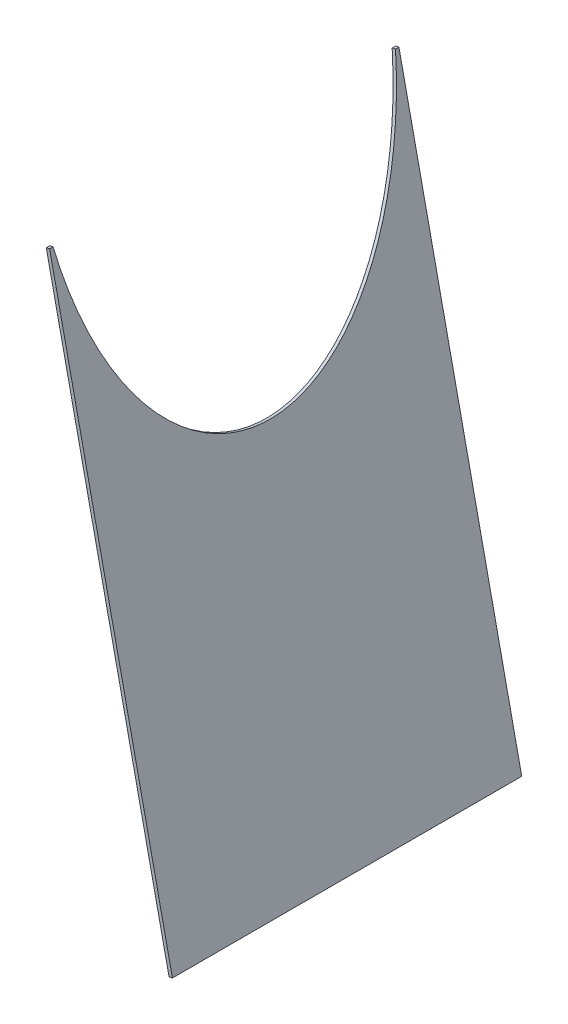
ISO-10303-21;
HEADER;
FILE_DESCRIPTION(('STEP AP214'),'2;1');
FILE_NAME('part.step','',(''),(''),'','','');
FILE_SCHEMA(('AUTOMOTIVE_DESIGN { 1 0 10303 214 1 1 1 1 }'));
ENDSEC;
DATA;
#1=APPLICATION_CONTEXT('core data for automotive mechanical design processes');
#2=APPLICATION_PROTOCOL_DEFINITION('international standard','automotive_design',2000,#1);
#3=PRODUCT_CONTEXT('',#1,'mechanical');
#4=PRODUCT('Part','Part','',(#3));
#5=PRODUCT_RELATED_PRODUCT_CATEGORY('part','',(#4));
#6=PRODUCT_DEFINITION_FORMATION('','',#4);
#7=PRODUCT_DEFINITION_CONTEXT('part definition',#1,'design');
#8=PRODUCT_DEFINITION('design','',#6,#7);
#9=PRODUCT_DEFINITION_SHAPE('','',#8);
#10=(LENGTH_UNIT() NAMED_UNIT(*) SI_UNIT(.MILLI.,.METRE.));
#11=(NAMED_UNIT(*) PLANE_ANGLE_UNIT() SI_UNIT($,.RADIAN.));
#12=(NAMED_UNIT(*) SI_UNIT($,.STERADIAN.) SOLID_ANGLE_UNIT());
#13=UNCERTAINTY_MEASURE_WITH_UNIT(LENGTH_MEASURE(1.E-05),#10,'distance_accuracy_value','');
#14=(GEOMETRIC_REPRESENTATION_CONTEXT(3) GLOBAL_UNCERTAINTY_ASSIGNED_CONTEXT((#13)) GLOBAL_UNIT_ASSIGNED_CONTEXT((#10,
#11,#12)) REPRESENTATION_CONTEXT('',''));
#15=CARTESIAN_POINT('',(0.,0.,0.));
#16=DIRECTION('',(0.,0.,1.));
#17=DIRECTION('',(1.,0.,0.));
#18=AXIS2_PLACEMENT_3D('',#15,#16,#17);
#19=CARTESIAN_POINT('',(0.,0.,102.));
#20=DIRECTION('',(0.,0.,-1.));
#21=DIRECTION('',(-1.,0.,0.));
#22=AXIS2_PLACEMENT_3D('',#19,#20,#21);
#23=PLANE('',#22);
#24=DIRECTION('',(-0.210541075170458,0.977585011989273,0.));
#25=VECTOR('',#24,1.);
#26=CARTESIAN_POINT('',(1873.05768333394,3149.43707076215,102.));
#27=LINE('',#26,#25);
#28=CARTESIAN_POINT('',(1873.05768333394,3149.43707076215,102.));
#29=VERTEX_POINT('',#28);
#30=CARTESIAN_POINT('',(1801.35282343149,3482.37731185606,102.));
#31=VERTEX_POINT('',#30);
#32=EDGE_CURVE('E118',#29,#31,#27,.T.);
#33=ORIENTED_EDGE('',*,*,#32,.T.);
#34=DIRECTION('',(0.977585011989273,0.210541075170458,0.));
#35=VECTOR('',#34,1.);
#36=CARTESIAN_POINT('',(823.767811442218,3271.8362366856,102.));
#37=LINE('',#36,#35);
#38=CARTESIAN_POINT('',(1799.39765340751,3481.95622970571,102.));
#39=VERTEX_POINT('',#38);
#40=EDGE_CURVE('E163',#39,#31,#37,.T.);
#41=ORIENTED_EDGE('',*,*,#40,.F.);
#42=DIRECTION('',(-0.210541075170458,0.977585011989273,0.));
#43=VECTOR('',#42,1.);
#44=CARTESIAN_POINT('',(1871.10251330996,3149.01598861181,102.));
#45=LINE('',#44,#43);
#46=CARTESIAN_POINT('',(1871.10251330996,3149.01598861181,102.));
#47=VERTEX_POINT('',#46);
#48=EDGE_CURVE('E162',#47,#39,#45,.T.);
#49=ORIENTED_EDGE('',*,*,#48,.F.);
#50=DIRECTION('',(-0.977585011989268,-0.210541075170482,0.));
#51=VECTOR('',#50,1.);
#52=CARTESIAN_POINT('',(1873.05768333394,3149.43707076215,102.));
#53=LINE('',#52,#51);
#54=EDGE_CURVE('E157',#29,#47,#53,.T.);
#55=ORIENTED_EDGE('',*,*,#54,.F.);
#56=EDGE_LOOP('',(#33,#41,#49,#55));
#57=FACE_BOUND('',#56,.T.);
#58=ADVANCED_FACE('F43',(#57),#23,.F.);
#59=CARTESIAN_POINT('',(0.,0.,-102.));
#60=DIRECTION('',(0.,0.,-1.));
#61=DIRECTION('',(-1.,0.,0.));
#62=AXIS2_PLACEMENT_3D('',#59,#60,#61);
#63=PLANE('',#62);
#64=DIRECTION('',(0.977585011989273,0.210541075170458,0.));
#65=VECTOR('',#64,1.);
#66=CARTESIAN_POINT('',(823.767811442218,3271.8362366856,-102.));
#67=LINE('',#66,#65);
#68=CARTESIAN_POINT('',(1799.39765340751,3481.95622970571,-102.));
#69=VERTEX_POINT('',#68);
#70=CARTESIAN_POINT('',(1801.35282343149,3482.37731185606,-102.));
#71=VERTEX_POINT('',#70);
#72=EDGE_CURVE('E102',#69,#71,#67,.T.);
#73=ORIENTED_EDGE('',*,*,#72,.T.);
#74=DIRECTION('',(-0.210541075170458,0.977585011989273,0.));
#75=VECTOR('',#74,1.);
#76=CARTESIAN_POINT('',(1873.05768333394,3149.43707076215,-102.));
#77=LINE('',#76,#75);
#78=CARTESIAN_POINT('',(1873.05768333394,3149.43707076215,-102.));
#79=VERTEX_POINT('',#78);
#80=EDGE_CURVE('E101',#79,#71,#77,.T.);
#81=ORIENTED_EDGE('',*,*,#80,.F.);
#82=DIRECTION('',(-0.977585011989268,-0.210541075170482,0.));
#83=VECTOR('',#82,1.);
#84=CARTESIAN_POINT('',(1873.05768333394,3149.43707076215,-102.));
#85=LINE('',#84,#83);
#86=CARTESIAN_POINT('',(1871.10251330996,3149.01598861181,-102.));
#87=VERTEX_POINT('',#86);
#88=EDGE_CURVE('E149',#79,#87,#85,.T.);
#89=ORIENTED_EDGE('',*,*,#88,.T.);
#90=DIRECTION('',(-0.210541075170458,0.977585011989273,0.));
#91=VECTOR('',#90,1.);
#92=CARTESIAN_POINT('',(1871.10251330996,3149.01598861181,-102.));
#93=LINE('',#92,#91);
#94=EDGE_CURVE('E109',#87,#69,#93,.T.);
#95=ORIENTED_EDGE('',*,*,#94,.T.);
#96=EDGE_LOOP('',(#73,#81,#89,#95));
#97=FACE_BOUND('',#96,.T.);
#98=ADVANCED_FACE('F129',(#97),#63,.T.);
#99=CARTESIAN_POINT('',(1873.05768333394,3149.43707076215,102.));
#100=DIRECTION('',(-0.977585011989273,-0.210541075170458,0.));
#101=DIRECTION('',(0.210541075170458,-0.977585011989273,0.));
#102=AXIS2_PLACEMENT_3D('',#99,#100,#101);
#103=PLANE('',#102);
#104=ORIENTED_EDGE('',*,*,#80,.T.);
#105=DIRECTION('',(0.,0.,-1.));
#106=VECTOR('',#105,1.);
#107=CARTESIAN_POINT('',(1801.35282343149,3482.37731185606,-99.9999999999996));
#108=LINE('',#107,#106);
#109=CARTESIAN_POINT('',(1801.35282343149,3482.37731185606,-99.9999999999996));
#110=VERTEX_POINT('',#109);
#111=EDGE_CURVE('E95',#110,#71,#108,.T.);
#112=ORIENTED_EDGE('',*,*,#111,.F.);
#113=CARTESIAN_POINT('',(1793.85026431913,3517.21321897713,0.));
#114=DIRECTION('',(-0.977585011989273,-0.210541075170458,0.));
#115=DIRECTION('',(-0.210541075170458,0.977585011989273,0.));
#116=AXIS2_PLACEMENT_3D('',#113,#114,#115);
#117=ELLIPSE('',#116,162.335662138775,102.5);
#118=CARTESIAN_POINT('',(1801.35282343149,3482.37731185606,99.9999999999996));
#119=VERTEX_POINT('',#118);
#120=EDGE_CURVE('E65',#110,#119,#117,.T.);
#121=ORIENTED_EDGE('',*,*,#120,.T.);
#122=DIRECTION('',(0.,0.,-1.));
#123=VECTOR('',#122,1.);
#124=CARTESIAN_POINT('',(1801.35282343149,3482.37731185606,102.));
#125=LINE('',#124,#123);
#126=EDGE_CURVE('E146',#31,#119,#125,.T.);
#127=ORIENTED_EDGE('',*,*,#126,.F.);
#128=ORIENTED_EDGE('',*,*,#32,.F.);
#129=DIRECTION('',(0.,0.,-1.));
#130=VECTOR('',#129,1.);
#131=CARTESIAN_POINT('',(1873.05768333394,3149.43707076215,102.));
#132=LINE('',#131,#130);
#133=EDGE_CURVE('E154',#29,#79,#132,.T.);
#134=ORIENTED_EDGE('',*,*,#133,.T.);
#135=EDGE_LOOP('',(#104,#112,#121,#127,#128,#134));
#136=FACE_BOUND('',#135,.T.);
#137=ADVANCED_FACE('F45',(#136),#103,.F.);
#138=CARTESIAN_POINT('',(1871.10251330996,3149.01598861181,102.));
#139=DIRECTION('',(-0.977585011989273,-0.210541075170458,0.));
#140=DIRECTION('',(0.210541075170458,-0.977585011989273,0.));
#141=AXIS2_PLACEMENT_3D('',#138,#139,#140);
#142=PLANE('',#141);
#143=DIRECTION('',(0.,0.,1.));
#144=VECTOR('',#143,1.);
#145=CARTESIAN_POINT('',(1799.39765340751,3481.95622970571,102.));
#146=LINE('',#145,#144);
#147=CARTESIAN_POINT('',(1799.39765340751,3481.95622970571,-99.9999999999996));
#148=VERTEX_POINT('',#147);
#149=EDGE_CURVE('E57',#69,#148,#146,.T.);
#150=ORIENTED_EDGE('',*,*,#149,.F.);
#151=ORIENTED_EDGE('',*,*,#94,.F.);
#152=DIRECTION('',(0.,0.,-1.));
#153=VECTOR('',#152,1.);
#154=CARTESIAN_POINT('',(1871.10251330996,3149.01598861181,102.));
#155=LINE('',#154,#153);
#156=EDGE_CURVE('E156',#47,#87,#155,.T.);
#157=ORIENTED_EDGE('',*,*,#156,.F.);
#158=ORIENTED_EDGE('',*,*,#48,.T.);
#159=DIRECTION('',(0.,0.,1.));
#160=VECTOR('',#159,1.);
#161=CARTESIAN_POINT('',(1799.39765340751,3481.95622970571,102.));
#162=LINE('',#161,#160);
#163=CARTESIAN_POINT('',(1799.39765340751,3481.95622970571,99.9999999999996));
#164=VERTEX_POINT('',#163);
#165=EDGE_CURVE('E111',#164,#39,#162,.T.);
#166=ORIENTED_EDGE('',*,*,#165,.F.);
#167=CARTESIAN_POINT('',(1791.89509429515,3516.79213682679,0.));
#168=DIRECTION('',(-0.977585011989273,-0.210541075170458,0.));
#169=DIRECTION('',(-0.210541075170458,0.977585011989273,0.));
#170=AXIS2_PLACEMENT_3D('',#167,#168,#169);
#171=ELLIPSE('',#170,162.335662138775,102.5);
#172=EDGE_CURVE('E107',#148,#164,#171,.T.);
#173=ORIENTED_EDGE('',*,*,#172,.F.);
#174=EDGE_LOOP('',(#150,#151,#157,#158,#166,#173));
#175=FACE_BOUND('',#174,.T.);
#176=ADVANCED_FACE('F135',(#175),#142,.T.);
#177=CARTESIAN_POINT('',(1873.05768333394,3149.43707076215,102.));
#178=DIRECTION('',(0.210541075170482,-0.977585011989268,0.));
#179=DIRECTION('',(0.977585011989268,0.210541075170482,0.));
#180=AXIS2_PLACEMENT_3D('',#177,#178,#179);
#181=PLANE('',#180);
#182=ORIENTED_EDGE('',*,*,#88,.F.);
#183=ORIENTED_EDGE('',*,*,#133,.F.);
#184=ORIENTED_EDGE('',*,*,#54,.T.);
#185=ORIENTED_EDGE('',*,*,#156,.T.);
#186=EDGE_LOOP('',(#182,#183,#184,#185));
#187=FACE_BOUND('',#186,.T.);
#188=ADVANCED_FACE('F125',(#187),#181,.T.);
#189=CARTESIAN_POINT('',(1791.89509429515,3516.79213682679,0.));
#190=DIRECTION('',(-0.977585011989273,-0.210541075170458,0.));
#191=DIRECTION('',(-0.210541075170458,0.977585011989273,0.));
#192=AXIS2_PLACEMENT_3D('',#189,#190,#191);
#193=ELLIPSE('',#192,162.335662138775,102.5);
#194=DIRECTION('',(-0.977585011989273,-0.210541075170458,0.));
#195=VECTOR('',#194,1.);
#196=SURFACE_OF_LINEAR_EXTRUSION('',#193,#195);
#197=DIRECTION('',(-0.977585011989273,-0.210541075170458,0.));
#198=VECTOR('',#197,1.);
#199=CARTESIAN_POINT('',(1799.39765340751,3481.95622970571,-99.9999999999996));
#200=LINE('',#199,#198);
#201=EDGE_CURVE('E11',#148,#110,#200,.F.);
#202=ORIENTED_EDGE('',*,*,#201,.F.);
#203=ORIENTED_EDGE('',*,*,#172,.T.);
#204=DIRECTION('',(-0.977585011989273,-0.210541075170458,0.));
#205=VECTOR('',#204,1.);
#206=CARTESIAN_POINT('',(1799.39765340751,3481.95622970571,99.9999999999996));
#207=LINE('',#206,#205);
#208=EDGE_CURVE('E51',#119,#164,#207,.T.);
#209=ORIENTED_EDGE('',*,*,#208,.F.);
#210=ORIENTED_EDGE('',*,*,#120,.F.);
#211=EDGE_LOOP('',(#202,#203,#209,#210));
#212=FACE_BOUND('',#211,.T.);
#213=ADVANCED_FACE('F105',(#212),#196,.F.);
#214=CARTESIAN_POINT('',(823.767811442218,3271.8362366856,102.));
#215=DIRECTION('',(0.210541075170458,-0.977585011989273,0.));
#216=DIRECTION('',(0.977585011989273,0.210541075170458,0.));
#217=AXIS2_PLACEMENT_3D('',#214,#215,#216);
#218=PLANE('',#217);
#219=ORIENTED_EDGE('',*,*,#165,.T.);
#220=ORIENTED_EDGE('',*,*,#40,.T.);
#221=ORIENTED_EDGE('',*,*,#126,.T.);
#222=ORIENTED_EDGE('',*,*,#208,.T.);
#223=EDGE_LOOP('',(#219,#220,#221,#222));
#224=FACE_BOUND('',#223,.T.);
#225=ADVANCED_FACE('F124',(#224),#218,.F.);
#226=CARTESIAN_POINT('',(823.767811442218,3271.8362366856,-99.9999999999996));
#227=DIRECTION('',(0.210541075170458,-0.977585011989273,0.));
#228=DIRECTION('',(0.977585011989273,0.210541075170458,0.));
#229=AXIS2_PLACEMENT_3D('',#226,#227,#228);
#230=PLANE('',#229);
#231=ORIENTED_EDGE('',*,*,#149,.T.);
#232=ORIENTED_EDGE('',*,*,#201,.T.);
#233=ORIENTED_EDGE('',*,*,#111,.T.);
#234=ORIENTED_EDGE('',*,*,#72,.F.);
#235=EDGE_LOOP('',(#231,#232,#233,#234));
#236=FACE_BOUND('',#235,.T.);
#237=ADVANCED_FACE('F94',(#236),#230,.F.);
#238=CLOSED_SHELL('',(#58,#98,#137,#176,#188,#213,#225,#237));
#239=MANIFOLD_SOLID_BREP('B2',#238);
#240=ADVANCED_BREP_SHAPE_REPRESENTATION('',(#18,#239),#14);
#241=SHAPE_DEFINITION_REPRESENTATION(#9,#240);
ENDSEC;
END-ISO-10303-21;
